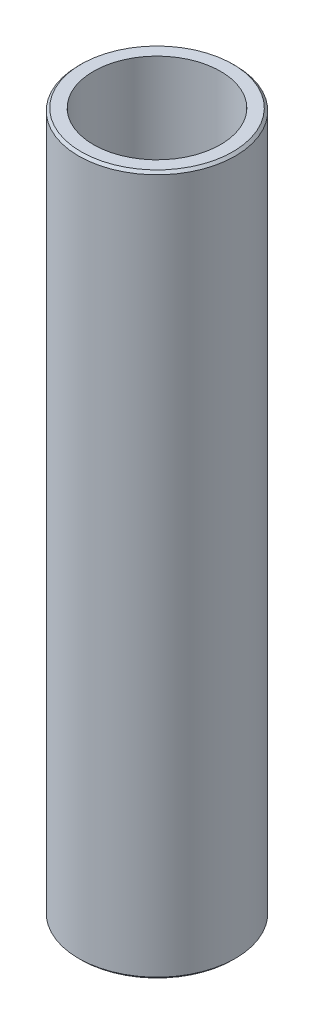
ISO-10303-21;
HEADER;
FILE_DESCRIPTION(('STEP AP214'),'2;1');
FILE_NAME('part.step','',(''),(''),'','','');
FILE_SCHEMA(('AUTOMOTIVE_DESIGN { 1 0 10303 214 1 1 1 1 }'));
ENDSEC;
DATA;
#1=APPLICATION_CONTEXT('core data for automotive mechanical design processes');
#2=APPLICATION_PROTOCOL_DEFINITION('international standard','automotive_design',2000,#1);
#3=PRODUCT_CONTEXT('',#1,'mechanical');
#4=PRODUCT('Part','Part','',(#3));
#5=PRODUCT_RELATED_PRODUCT_CATEGORY('part','',(#4));
#6=PRODUCT_DEFINITION_FORMATION('','',#4);
#7=PRODUCT_DEFINITION_CONTEXT('part definition',#1,'design');
#8=PRODUCT_DEFINITION('design','',#6,#7);
#9=PRODUCT_DEFINITION_SHAPE('','',#8);
#10=(LENGTH_UNIT() NAMED_UNIT(*) SI_UNIT(.MILLI.,.METRE.));
#11=(NAMED_UNIT(*) PLANE_ANGLE_UNIT() SI_UNIT($,.RADIAN.));
#12=(NAMED_UNIT(*) SI_UNIT($,.STERADIAN.) SOLID_ANGLE_UNIT());
#13=UNCERTAINTY_MEASURE_WITH_UNIT(LENGTH_MEASURE(1.E-05),#10,'distance_accuracy_value','');
#14=(GEOMETRIC_REPRESENTATION_CONTEXT(3) GLOBAL_UNCERTAINTY_ASSIGNED_CONTEXT((#13)) GLOBAL_UNIT_ASSIGNED_CONTEXT((#10,
#11,#12)) REPRESENTATION_CONTEXT('',''));
#15=CARTESIAN_POINT('',(0.,0.,0.));
#16=DIRECTION('',(0.,0.,1.));
#17=DIRECTION('',(1.,0.,0.));
#18=AXIS2_PLACEMENT_3D('',#15,#16,#17);
#19=CARTESIAN_POINT('',(0.,70.91,0.));
#20=DIRECTION('',(0.,1.,0.));
#21=DIRECTION('',(0.,0.,1.));
#22=AXIS2_PLACEMENT_3D('',#19,#20,#21);
#23=PLANE('',#22);
#24=CARTESIAN_POINT('',(0.,70.91,0.));
#25=DIRECTION('',(0.,1.,0.));
#26=DIRECTION('',(0.,0.,1.));
#27=AXIS2_PLACEMENT_3D('',#24,#25,#26);
#28=CIRCLE('',#27,7.69000000000002);
#29=CARTESIAN_POINT('',(0.,70.91,7.69000000000002));
#30=VERTEX_POINT('',#29);
#31=EDGE_CURVE('E10',#30,#30,#28,.T.);
#32=ORIENTED_EDGE('',*,*,#31,.T.);
#33=EDGE_LOOP('',(#32));
#34=FACE_BOUND('',#33,.T.);
#35=CARTESIAN_POINT('',(0.,70.91,0.));
#36=DIRECTION('',(0.,1.,0.));
#37=DIRECTION('',(0.,0.,1.));
#38=AXIS2_PLACEMENT_3D('',#35,#36,#37);
#39=CIRCLE('',#38,6.44);
#40=CARTESIAN_POINT('',(0.,70.91,6.44));
#41=VERTEX_POINT('',#40);
#42=EDGE_CURVE('E51',#41,#41,#39,.T.);
#43=ORIENTED_EDGE('',*,*,#42,.F.);
#44=EDGE_LOOP('',(#43));
#45=FACE_BOUND('',#44,.T.);
#46=ADVANCED_FACE('F31',(#34,#45),#23,.T.);
#47=CARTESIAN_POINT('',(0.,0.,0.));
#48=DIRECTION('',(0.,1.,0.));
#49=DIRECTION('',(0.,0.,1.));
#50=AXIS2_PLACEMENT_3D('',#47,#48,#49);
#51=PLANE('',#50);
#52=CARTESIAN_POINT('',(0.,0.,0.));
#53=DIRECTION('',(0.,1.,0.));
#54=DIRECTION('',(0.,0.,1.));
#55=AXIS2_PLACEMENT_3D('',#52,#53,#54);
#56=CIRCLE('',#55,7.69);
#57=CARTESIAN_POINT('',(0.,0.,7.69));
#58=VERTEX_POINT('',#57);
#59=EDGE_CURVE('E38',#58,#58,#56,.F.);
#60=ORIENTED_EDGE('',*,*,#59,.T.);
#61=EDGE_LOOP('',(#60));
#62=FACE_BOUND('',#61,.T.);
#63=CARTESIAN_POINT('',(0.,0.,0.));
#64=DIRECTION('',(0.,1.,0.));
#65=DIRECTION('',(0.,0.,1.));
#66=AXIS2_PLACEMENT_3D('',#63,#64,#65);
#67=CIRCLE('',#66,6.44);
#68=CARTESIAN_POINT('',(0.,0.,6.44));
#69=VERTEX_POINT('',#68);
#70=EDGE_CURVE('E52',#69,#69,#67,.T.);
#71=ORIENTED_EDGE('',*,*,#70,.T.);
#72=EDGE_LOOP('',(#71));
#73=FACE_BOUND('',#72,.T.);
#74=ADVANCED_FACE('F62',(#62,#73),#51,.F.);
#75=CARTESIAN_POINT('',(0.,70.91,0.));
#76=DIRECTION('',(0.,-1.,0.));
#77=DIRECTION('',(0.,0.,-1.));
#78=AXIS2_PLACEMENT_3D('',#75,#76,#77);
#79=CYLINDRICAL_SURFACE('',#78,7.94);
#80=CARTESIAN_POINT('',(0.,0.25,0.));
#81=DIRECTION('',(0.,1.,0.));
#82=DIRECTION('',(0.,0.,1.));
#83=AXIS2_PLACEMENT_3D('',#80,#81,#82);
#84=CIRCLE('',#83,7.94);
#85=CARTESIAN_POINT('',(0.,0.25,7.94));
#86=VERTEX_POINT('',#85);
#87=EDGE_CURVE('E42',#86,#86,#84,.T.);
#88=ORIENTED_EDGE('',*,*,#87,.T.);
#89=EDGE_LOOP('',(#88));
#90=FACE_BOUND('',#89,.T.);
#91=CARTESIAN_POINT('',(0.,70.66,0.));
#92=DIRECTION('',(0.,1.,0.));
#93=DIRECTION('',(0.,0.,1.));
#94=AXIS2_PLACEMENT_3D('',#91,#92,#93);
#95=CIRCLE('',#94,7.94);
#96=CARTESIAN_POINT('',(0.,70.66,7.94));
#97=VERTEX_POINT('',#96);
#98=EDGE_CURVE('E46',#97,#97,#95,.F.);
#99=ORIENTED_EDGE('',*,*,#98,.T.);
#100=EDGE_LOOP('',(#99));
#101=FACE_BOUND('',#100,.T.);
#102=ADVANCED_FACE('F67',(#90,#101),#79,.T.);
#103=CARTESIAN_POINT('',(0.,70.91,0.));
#104=DIRECTION('',(0.,-1.,0.));
#105=DIRECTION('',(0.,0.,-1.));
#106=AXIS2_PLACEMENT_3D('',#103,#104,#105);
#107=CYLINDRICAL_SURFACE('',#106,6.44);
#108=ORIENTED_EDGE('',*,*,#42,.T.);
#109=EDGE_LOOP('',(#108));
#110=FACE_BOUND('',#109,.T.);
#111=ORIENTED_EDGE('',*,*,#70,.F.);
#112=EDGE_LOOP('',(#111));
#113=FACE_BOUND('',#112,.T.);
#114=ADVANCED_FACE('F58',(#110,#113),#107,.F.);
#115=CARTESIAN_POINT('',(0.,0.25,0.));
#116=DIRECTION('',(0.,1.,0.));
#117=DIRECTION('',(0.,0.,1.));
#118=AXIS2_PLACEMENT_3D('',#115,#116,#117);
#119=CONICAL_SURFACE('',#118,7.94,0.785398163397448);
#120=ORIENTED_EDGE('',*,*,#59,.F.);
#121=EDGE_LOOP('',(#120));
#122=FACE_BOUND('',#121,.T.);
#123=ORIENTED_EDGE('',*,*,#87,.F.);
#124=EDGE_LOOP('',(#123));
#125=FACE_BOUND('',#124,.T.);
#126=ADVANCED_FACE('F73',(#122,#125),#119,.T.);
#127=CARTESIAN_POINT('',(0.,70.91,0.));
#128=DIRECTION('',(0.,-1.,0.));
#129=DIRECTION('',(0.,0.,-1.));
#130=AXIS2_PLACEMENT_3D('',#127,#128,#129);
#131=CONICAL_SURFACE('',#130,7.69000000000002,0.785398163397435);
#132=ORIENTED_EDGE('',*,*,#98,.F.);
#133=EDGE_LOOP('',(#132));
#134=FACE_BOUND('',#133,.T.);
#135=ORIENTED_EDGE('',*,*,#31,.F.);
#136=EDGE_LOOP('',(#135));
#137=FACE_BOUND('',#136,.T.);
#138=ADVANCED_FACE('F33',(#134,#137),#131,.T.);
#139=CLOSED_SHELL('',(#46,#74,#102,#114,#126,#138));
#140=MANIFOLD_SOLID_BREP('B2',#139);
#141=ADVANCED_BREP_SHAPE_REPRESENTATION('',(#18,#140),#14);
#142=SHAPE_DEFINITION_REPRESENTATION(#9,#141);
ENDSEC;
END-ISO-10303-21;
